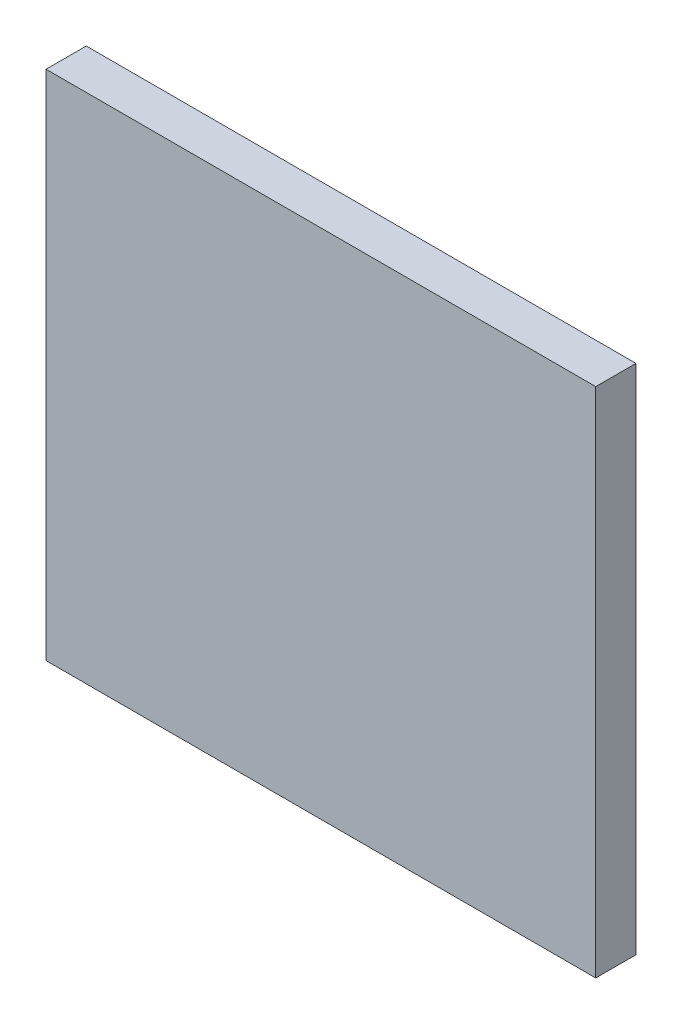
ISO-10303-21;
HEADER;
FILE_DESCRIPTION(('STEP AP214'),'2;1');
FILE_NAME('part.step','',(''),(''),'','','');
FILE_SCHEMA(('AUTOMOTIVE_DESIGN { 1 0 10303 214 1 1 1 1 }'));
ENDSEC;
DATA;
#1=APPLICATION_CONTEXT('core data for automotive mechanical design processes');
#2=APPLICATION_PROTOCOL_DEFINITION('international standard','automotive_design',2000,#1);
#3=PRODUCT_CONTEXT('',#1,'mechanical');
#4=PRODUCT('Part','Part','',(#3));
#5=PRODUCT_RELATED_PRODUCT_CATEGORY('part','',(#4));
#6=PRODUCT_DEFINITION_FORMATION('','',#4);
#7=PRODUCT_DEFINITION_CONTEXT('part definition',#1,'design');
#8=PRODUCT_DEFINITION('design','',#6,#7);
#9=PRODUCT_DEFINITION_SHAPE('','',#8);
#10=(LENGTH_UNIT() NAMED_UNIT(*) SI_UNIT(.MILLI.,.METRE.));
#11=(NAMED_UNIT(*) PLANE_ANGLE_UNIT() SI_UNIT($,.RADIAN.));
#12=(NAMED_UNIT(*) SI_UNIT($,.STERADIAN.) SOLID_ANGLE_UNIT());
#13=UNCERTAINTY_MEASURE_WITH_UNIT(LENGTH_MEASURE(1.E-05),#10,'distance_accuracy_value','');
#14=(GEOMETRIC_REPRESENTATION_CONTEXT(3) GLOBAL_UNCERTAINTY_ASSIGNED_CONTEXT((#13)) GLOBAL_UNIT_ASSIGNED_CONTEXT((#10,
#11,#12)) REPRESENTATION_CONTEXT('',''));
#15=CARTESIAN_POINT('',(0.,0.,0.));
#16=DIRECTION('',(0.,0.,1.));
#17=DIRECTION('',(1.,0.,0.));
#18=AXIS2_PLACEMENT_3D('',#15,#16,#17);
#19=CARTESIAN_POINT('',(0.,0.,-30.));
#20=DIRECTION('',(0.,0.,1.));
#21=DIRECTION('',(1.,0.,0.));
#22=AXIS2_PLACEMENT_3D('',#19,#20,#21);
#23=PLANE('',#22);
#24=DIRECTION('',(0.,1.,0.));
#25=VECTOR('',#24,1.);
#26=CARTESIAN_POINT('',(3210.,-1330.,-30.));
#27=LINE('',#26,#25);
#28=CARTESIAN_POINT('',(3210.,-847.,-30.));
#29=VERTEX_POINT('',#28);
#30=CARTESIAN_POINT('',(3210.,-465.,-30.));
#31=VERTEX_POINT('',#30);
#32=EDGE_CURVE('E46',#29,#31,#27,.T.);
#33=ORIENTED_EDGE('',*,*,#32,.T.);
#34=DIRECTION('',(1.,0.,0.));
#35=VECTOR('',#34,1.);
#36=CARTESIAN_POINT('',(3210.,-465.,-30.));
#37=LINE('',#36,#35);
#38=CARTESIAN_POINT('',(3620.,-465.,-30.));
#39=VERTEX_POINT('',#38);
#40=EDGE_CURVE('E79',#31,#39,#37,.T.);
#41=ORIENTED_EDGE('',*,*,#40,.T.);
#42=DIRECTION('',(0.,-1.,0.));
#43=VECTOR('',#42,1.);
#44=CARTESIAN_POINT('',(3620.,-310.,-30.));
#45=LINE('',#44,#43);
#46=CARTESIAN_POINT('',(3620.,-847.,-30.));
#47=VERTEX_POINT('',#46);
#48=EDGE_CURVE('E104',#39,#47,#45,.T.);
#49=ORIENTED_EDGE('',*,*,#48,.T.);
#50=DIRECTION('',(1.,0.,0.));
#51=VECTOR('',#50,1.);
#52=CARTESIAN_POINT('',(0.,-847.,-30.));
#53=LINE('',#52,#51);
#54=EDGE_CURVE('E94',#47,#29,#53,.F.);
#55=ORIENTED_EDGE('',*,*,#54,.T.);
#56=EDGE_LOOP('',(#33,#41,#49,#55));
#57=FACE_BOUND('',#56,.T.);
#58=ADVANCED_FACE('F38',(#57),#23,.F.);
#59=CARTESIAN_POINT('',(0.,0.,0.));
#60=DIRECTION('',(0.,0.,1.));
#61=DIRECTION('',(1.,0.,0.));
#62=AXIS2_PLACEMENT_3D('',#59,#60,#61);
#63=PLANE('',#62);
#64=DIRECTION('',(1.,0.,0.));
#65=VECTOR('',#64,1.);
#66=CARTESIAN_POINT('',(0.,-465.,0.));
#67=LINE('',#66,#65);
#68=CARTESIAN_POINT('',(3210.,-465.,0.));
#69=VERTEX_POINT('',#68);
#70=CARTESIAN_POINT('',(3620.,-465.,0.));
#71=VERTEX_POINT('',#70);
#72=EDGE_CURVE('E53',#69,#71,#67,.T.);
#73=ORIENTED_EDGE('',*,*,#72,.F.);
#74=DIRECTION('',(0.,1.,0.));
#75=VECTOR('',#74,1.);
#76=CARTESIAN_POINT('',(3210.,0.,0.));
#77=LINE('',#76,#75);
#78=CARTESIAN_POINT('',(3210.,-847.,0.));
#79=VERTEX_POINT('',#78);
#80=EDGE_CURVE('E11',#79,#69,#77,.T.);
#81=ORIENTED_EDGE('',*,*,#80,.F.);
#82=DIRECTION('',(-1.,0.,0.));
#83=VECTOR('',#82,1.);
#84=CARTESIAN_POINT('',(0.,-847.,0.));
#85=LINE('',#84,#83);
#86=CARTESIAN_POINT('',(3620.,-847.,0.));
#87=VERTEX_POINT('',#86);
#88=EDGE_CURVE('E61',#87,#79,#85,.T.);
#89=ORIENTED_EDGE('',*,*,#88,.F.);
#90=DIRECTION('',(0.,-1.,0.));
#91=VECTOR('',#90,1.);
#92=CARTESIAN_POINT('',(3620.,0.,0.));
#93=LINE('',#92,#91);
#94=EDGE_CURVE('E99',#71,#87,#93,.T.);
#95=ORIENTED_EDGE('',*,*,#94,.F.);
#96=EDGE_LOOP('',(#73,#81,#89,#95));
#97=FACE_BOUND('',#96,.T.);
#98=ADVANCED_FACE('F40',(#97),#63,.T.);
#99=CARTESIAN_POINT('',(3210.,-1330.,-30.));
#100=DIRECTION('',(1.,0.,0.));
#101=DIRECTION('',(0.,0.,-1.));
#102=AXIS2_PLACEMENT_3D('',#99,#100,#101);
#103=PLANE('',#102);
#104=ORIENTED_EDGE('',*,*,#80,.T.);
#105=DIRECTION('',(0.,0.,1.));
#106=VECTOR('',#105,1.);
#107=CARTESIAN_POINT('',(3210.,-465.,-30.));
#108=LINE('',#107,#106);
#109=EDGE_CURVE('E82',#31,#69,#108,.T.);
#110=ORIENTED_EDGE('',*,*,#109,.F.);
#111=ORIENTED_EDGE('',*,*,#32,.F.);
#112=DIRECTION('',(0.,0.,1.));
#113=VECTOR('',#112,1.);
#114=CARTESIAN_POINT('',(3210.,-847.,0.));
#115=LINE('',#114,#113);
#116=EDGE_CURVE('E95',#79,#29,#115,.F.);
#117=ORIENTED_EDGE('',*,*,#116,.F.);
#118=EDGE_LOOP('',(#104,#110,#111,#117));
#119=FACE_BOUND('',#118,.T.);
#120=ADVANCED_FACE('F90',(#119),#103,.F.);
#121=CARTESIAN_POINT('',(0.,-847.,0.));
#122=DIRECTION('',(0.,1.,0.));
#123=DIRECTION('',(-1.,0.,0.));
#124=AXIS2_PLACEMENT_3D('',#121,#122,#123);
#125=PLANE('',#124);
#126=DIRECTION('',(0.,0.,1.));
#127=VECTOR('',#126,1.);
#128=CARTESIAN_POINT('',(3620.,-847.,-30.));
#129=LINE('',#128,#127);
#130=EDGE_CURVE('E102',#47,#87,#129,.T.);
#131=ORIENTED_EDGE('',*,*,#130,.T.);
#132=ORIENTED_EDGE('',*,*,#88,.T.);
#133=ORIENTED_EDGE('',*,*,#116,.T.);
#134=ORIENTED_EDGE('',*,*,#54,.F.);
#135=EDGE_LOOP('',(#131,#132,#133,#134));
#136=FACE_BOUND('',#135,.T.);
#137=ADVANCED_FACE('F117',(#136),#125,.F.);
#138=CARTESIAN_POINT('',(3620.,-310.,-30.));
#139=DIRECTION('',(-1.,0.,0.));
#140=DIRECTION('',(0.,0.,1.));
#141=AXIS2_PLACEMENT_3D('',#138,#139,#140);
#142=PLANE('',#141);
#143=ORIENTED_EDGE('',*,*,#48,.F.);
#144=DIRECTION('',(0.,0.,1.));
#145=VECTOR('',#144,1.);
#146=CARTESIAN_POINT('',(3620.,-465.,-30.));
#147=LINE('',#146,#145);
#148=EDGE_CURVE('E83',#39,#71,#147,.T.);
#149=ORIENTED_EDGE('',*,*,#148,.T.);
#150=ORIENTED_EDGE('',*,*,#94,.T.);
#151=ORIENTED_EDGE('',*,*,#130,.F.);
#152=EDGE_LOOP('',(#143,#149,#150,#151));
#153=FACE_BOUND('',#152,.T.);
#154=ADVANCED_FACE('F109',(#153),#142,.F.);
#155=CARTESIAN_POINT('',(3210.,-465.,-30.));
#156=DIRECTION('',(0.,-1.,0.));
#157=DIRECTION('',(0.,0.,-1.));
#158=AXIS2_PLACEMENT_3D('',#155,#156,#157);
#159=PLANE('',#158);
#160=ORIENTED_EDGE('',*,*,#72,.T.);
#161=ORIENTED_EDGE('',*,*,#148,.F.);
#162=ORIENTED_EDGE('',*,*,#40,.F.);
#163=ORIENTED_EDGE('',*,*,#109,.T.);
#164=EDGE_LOOP('',(#160,#161,#162,#163));
#165=FACE_BOUND('',#164,.T.);
#166=ADVANCED_FACE('F81',(#165),#159,.F.);
#167=CLOSED_SHELL('',(#58,#98,#120,#137,#154,#166));
#168=MANIFOLD_SOLID_BREP('B2',#167);
#169=ADVANCED_BREP_SHAPE_REPRESENTATION('',(#18,#168),#14);
#170=SHAPE_DEFINITION_REPRESENTATION(#9,#169);
ENDSEC;
END-ISO-10303-21;
